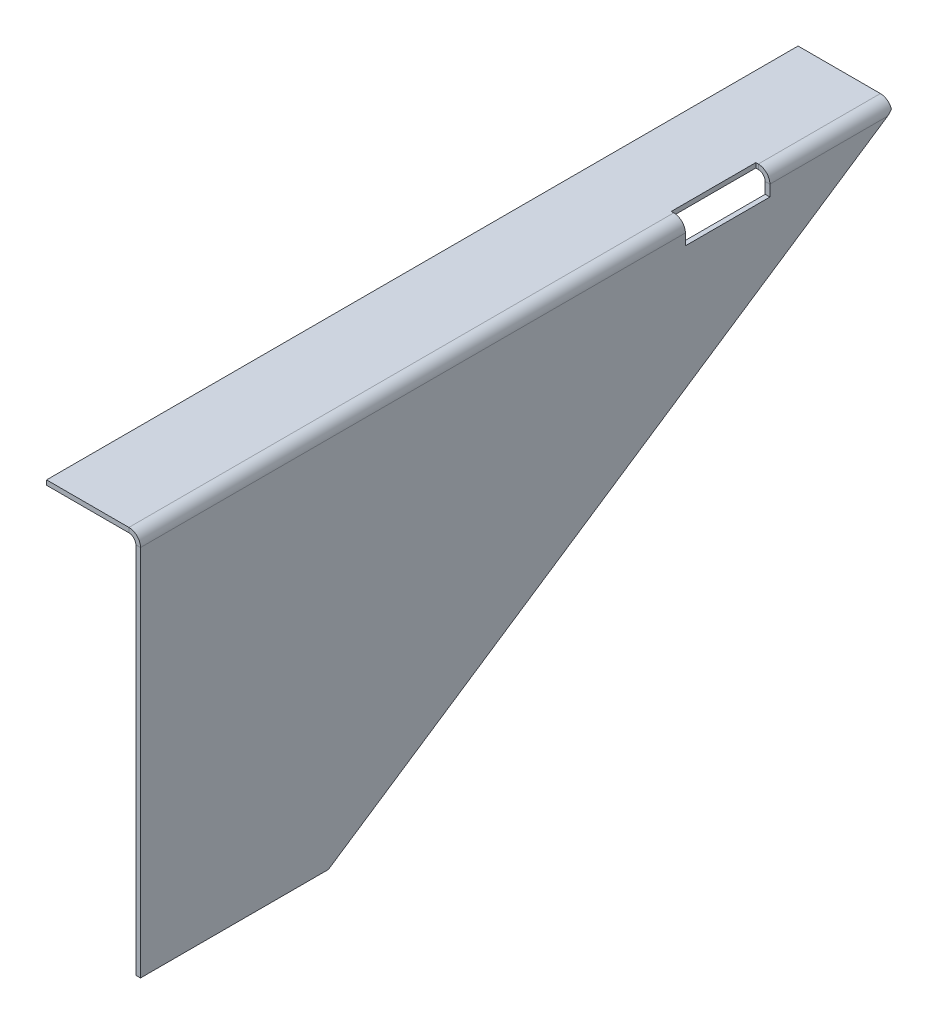
ISO-10303-21;
HEADER;
FILE_DESCRIPTION(('STEP AP214'),'2;1');
FILE_NAME('part.step','',(''),(''),'','','');
FILE_SCHEMA(('AUTOMOTIVE_DESIGN { 1 0 10303 214 1 1 1 1 }'));
ENDSEC;
DATA;
#1=APPLICATION_CONTEXT('core data for automotive mechanical design processes');
#2=APPLICATION_PROTOCOL_DEFINITION('international standard','automotive_design',2000,#1);
#3=PRODUCT_CONTEXT('',#1,'mechanical');
#4=PRODUCT('Part','Part','',(#3));
#5=PRODUCT_RELATED_PRODUCT_CATEGORY('part','',(#4));
#6=PRODUCT_DEFINITION_FORMATION('','',#4);
#7=PRODUCT_DEFINITION_CONTEXT('part definition',#1,'design');
#8=PRODUCT_DEFINITION('design','',#6,#7);
#9=PRODUCT_DEFINITION_SHAPE('','',#8);
#10=(LENGTH_UNIT() NAMED_UNIT(*) SI_UNIT(.MILLI.,.METRE.));
#11=(NAMED_UNIT(*) PLANE_ANGLE_UNIT() SI_UNIT($,.RADIAN.));
#12=(NAMED_UNIT(*) SI_UNIT($,.STERADIAN.) SOLID_ANGLE_UNIT());
#13=UNCERTAINTY_MEASURE_WITH_UNIT(LENGTH_MEASURE(1.E-05),#10,'distance_accuracy_value','');
#14=(GEOMETRIC_REPRESENTATION_CONTEXT(3) GLOBAL_UNCERTAINTY_ASSIGNED_CONTEXT((#13)) GLOBAL_UNIT_ASSIGNED_CONTEXT((#10,
#11,#12)) REPRESENTATION_CONTEXT('',''));
#15=CARTESIAN_POINT('',(0.,0.,0.));
#16=DIRECTION('',(0.,0.,1.));
#17=DIRECTION('',(1.,0.,0.));
#18=AXIS2_PLACEMENT_3D('',#15,#16,#17);
#19=CARTESIAN_POINT('',(-15.5000000000001,-15.9234523439842,0.));
#20=DIRECTION('',(1.,0.,0.));
#21=DIRECTION('',(0.,0.,1.));
#22=AXIS2_PLACEMENT_3D('',#19,#20,#21);
#23=PLANE('',#22);
#24=DIRECTION('',(0.,-1.,0.));
#25=VECTOR('',#24,1.);
#26=CARTESIAN_POINT('',(-15.5,9.07654765601584,40.));
#27=LINE('',#26,#25);
#28=CARTESIAN_POINT('',(-15.5,-1.2366,40.));
#29=VERTEX_POINT('',#28);
#30=CARTESIAN_POINT('',(-15.5000000000001,-40.9234523439842,40.));
#31=VERTEX_POINT('',#30);
#32=EDGE_CURVE('E223',#29,#31,#27,.T.);
#33=ORIENTED_EDGE('',*,*,#32,.F.);
#34=DIRECTION('',(0.,0.,-1.));
#35=VECTOR('',#34,1.);
#36=CARTESIAN_POINT('',(-15.5,-1.2366,0.));
#37=LINE('',#36,#35);
#38=CARTESIAN_POINT('',(-15.5,-1.2366,-18.));
#39=VERTEX_POINT('',#38);
#40=EDGE_CURVE('E377',#29,#39,#37,.T.);
#41=ORIENTED_EDGE('',*,*,#40,.T.);
#42=DIRECTION('',(0.,1.,0.));
#43=VECTOR('',#42,1.);
#44=CARTESIAN_POINT('',(-15.5,0.576547656015846,-18.));
#45=LINE('',#44,#43);
#46=CARTESIAN_POINT('',(-15.5,-2.42345234398416,-18.));
#47=VERTEX_POINT('',#46);
#48=EDGE_CURVE('E216',#47,#39,#45,.T.);
#49=ORIENTED_EDGE('',*,*,#48,.F.);
#50=DIRECTION('',(0.,0.,-1.));
#51=VECTOR('',#50,1.);
#52=CARTESIAN_POINT('',(-15.5,-2.42345234398416,-27.));
#53=LINE('',#52,#51);
#54=CARTESIAN_POINT('',(-15.5,-2.42345234398416,-27.));
#55=VERTEX_POINT('',#54);
#56=EDGE_CURVE('E198',#47,#55,#53,.T.);
#57=ORIENTED_EDGE('',*,*,#56,.T.);
#58=DIRECTION('',(0.,1.,0.));
#59=VECTOR('',#58,1.);
#60=CARTESIAN_POINT('',(-15.5,0.576547656015849,-27.));
#61=LINE('',#60,#59);
#62=CARTESIAN_POINT('',(-15.5,-1.2366,-27.));
#63=VERTEX_POINT('',#62);
#64=EDGE_CURVE('E195',#55,#63,#61,.T.);
#65=ORIENTED_EDGE('',*,*,#64,.T.);
#66=DIRECTION('',(0.,0.,-1.));
#67=VECTOR('',#66,1.);
#68=CARTESIAN_POINT('',(-15.5,-1.2366,0.));
#69=LINE('',#68,#67);
#70=CARTESIAN_POINT('',(-15.5,-1.23659999999999,-39.5302785159762));
#71=VERTEX_POINT('',#70);
#72=EDGE_CURVE('E172',#63,#71,#69,.T.);
#73=ORIENTED_EDGE('',*,*,#72,.T.);
#74=DIRECTION('',(0.,0.554700196225229,-0.832050294337844));
#75=VECTOR('',#74,1.);
#76=CARTESIAN_POINT('',(-15.5000000000001,-40.9234523439842,20.));
#77=LINE('',#76,#75);
#78=CARTESIAN_POINT('',(-15.5000000000001,-40.9234523439842,20.));
#79=VERTEX_POINT('',#78);
#80=EDGE_CURVE('E229',#79,#71,#77,.T.);
#81=ORIENTED_EDGE('',*,*,#80,.F.);
#82=DIRECTION('',(0.,0.,-1.));
#83=VECTOR('',#82,1.);
#84=CARTESIAN_POINT('',(-15.5000000000001,-40.9234523439842,40.));
#85=LINE('',#84,#83);
#86=EDGE_CURVE('E224',#31,#79,#85,.T.);
#87=ORIENTED_EDGE('',*,*,#86,.F.);
#88=EDGE_LOOP('',(#33,#41,#49,#57,#65,#73,#81,#87));
#89=FACE_BOUND('',#88,.T.);
#90=ADVANCED_FACE('F50',(#89),#23,.F.);
#91=CARTESIAN_POINT('',(-15.501,0.576547656015846,-18.));
#92=DIRECTION('',(0.,0.,1.));
#93=DIRECTION('',(0.,-1.,0.));
#94=AXIS2_PLACEMENT_3D('',#91,#92,#93);
#95=PLANE('',#94);
#96=ORIENTED_EDGE('',*,*,#48,.T.);
#97=DIRECTION('',(1.,0.,0.));
#98=VECTOR('',#97,1.);
#99=CARTESIAN_POINT('',(-15.501,-1.23659999999999,-18.));
#100=LINE('',#99,#98);
#101=CARTESIAN_POINT('',(-15.,-1.2366,-18.));
#102=VERTEX_POINT('',#101);
#103=EDGE_CURVE('E182',#39,#102,#100,.T.);
#104=ORIENTED_EDGE('',*,*,#103,.T.);
#105=DIRECTION('',(0.,-1.,0.));
#106=VECTOR('',#105,1.);
#107=CARTESIAN_POINT('',(-15.,0.576547656015842,-18.));
#108=LINE('',#107,#106);
#109=CARTESIAN_POINT('',(-15.,-2.42345234398416,-18.));
#110=VERTEX_POINT('',#109);
#111=EDGE_CURVE('E201',#102,#110,#108,.T.);
#112=ORIENTED_EDGE('',*,*,#111,.T.);
#113=DIRECTION('',(1.,0.,0.));
#114=VECTOR('',#113,1.);
#115=CARTESIAN_POINT('',(-15.501,-2.42345234398416,-18.));
#116=LINE('',#115,#114);
#117=EDGE_CURVE('E212',#47,#110,#116,.T.);
#118=ORIENTED_EDGE('',*,*,#117,.F.);
#119=EDGE_LOOP('',(#96,#104,#112,#118));
#120=FACE_BOUND('',#119,.T.);
#121=ADVANCED_FACE('F52',(#120),#95,.F.);
#122=CARTESIAN_POINT('',(-15.5000000000001,-40.9234523439842,20.));
#123=DIRECTION('',(0.,-0.832050294337844,-0.554700196225229));
#124=DIRECTION('',(0.,0.554700196225229,-0.832050294337844));
#125=AXIS2_PLACEMENT_3D('',#122,#123,#124);
#126=PLANE('',#125);
#127=CARTESIAN_POINT('',(-15.,-1.2366,-39.5302785159762));
#128=CARTESIAN_POINT('',(-15.5,-1.2366,-39.5302785159762));
#129=B_SPLINE_CURVE_WITH_KNOTS('',1,(#127,#128),.UNSPECIFIED.,.F.,.F.,(2,2),(0.,1.),.UNSPECIFIED.);
#130=CARTESIAN_POINT('',(-15.,-1.23659999999999,-39.5302785159762));
#131=VERTEX_POINT('',#130);
#132=EDGE_CURVE('E12',#131,#71,#129,.T.);
#133=ORIENTED_EDGE('',*,*,#132,.F.);
#134=DIRECTION('',(0.,0.554700196225229,-0.832050294337844));
#135=VECTOR('',#134,1.);
#136=CARTESIAN_POINT('',(-15.0000000000001,-40.9234523439842,20.));
#137=LINE('',#136,#135);
#138=CARTESIAN_POINT('',(-15.0000000000001,-40.9234523439842,20.));
#139=VERTEX_POINT('',#138);
#140=EDGE_CURVE('E225',#139,#131,#137,.T.);
#141=ORIENTED_EDGE('',*,*,#140,.F.);
#142=DIRECTION('',(1.,0.,0.));
#143=VECTOR('',#142,1.);
#144=CARTESIAN_POINT('',(-15.5000000000001,-40.9234523439842,20.));
#145=LINE('',#144,#143);
#146=EDGE_CURVE('E375',#79,#139,#145,.T.);
#147=ORIENTED_EDGE('',*,*,#146,.F.);
#148=ORIENTED_EDGE('',*,*,#80,.T.);
#149=EDGE_LOOP('',(#133,#141,#147,#148));
#150=FACE_BOUND('',#149,.T.);
#151=ADVANCED_FACE('F242',(#150),#126,.T.);
#152=CARTESIAN_POINT('',(-15.5000000000001,-40.9234523439842,40.));
#153=DIRECTION('',(0.,-1.,0.));
#154=DIRECTION('',(0.,0.,-1.));
#155=AXIS2_PLACEMENT_3D('',#152,#153,#154);
#156=PLANE('',#155);
#157=DIRECTION('',(0.,0.,-1.));
#158=VECTOR('',#157,1.);
#159=CARTESIAN_POINT('',(-15.0000000000001,-40.9234523439842,40.));
#160=LINE('',#159,#158);
#161=CARTESIAN_POINT('',(-15.0000000000001,-40.9234523439842,40.));
#162=VERTEX_POINT('',#161);
#163=EDGE_CURVE('E222',#162,#139,#160,.T.);
#164=ORIENTED_EDGE('',*,*,#163,.F.);
#165=DIRECTION('',(1.,0.,0.));
#166=VECTOR('',#165,1.);
#167=CARTESIAN_POINT('',(-15.5000000000001,-40.9234523439842,40.));
#168=LINE('',#167,#166);
#169=EDGE_CURVE('E231',#31,#162,#168,.T.);
#170=ORIENTED_EDGE('',*,*,#169,.F.);
#171=ORIENTED_EDGE('',*,*,#86,.T.);
#172=ORIENTED_EDGE('',*,*,#146,.T.);
#173=EDGE_LOOP('',(#164,#170,#171,#172));
#174=FACE_BOUND('',#173,.T.);
#175=ADVANCED_FACE('F486',(#174),#156,.T.);
#176=CARTESIAN_POINT('',(-15.5,9.07654765601584,40.));
#177=DIRECTION('',(0.,0.,1.));
#178=DIRECTION('',(0.,-1.,0.));
#179=AXIS2_PLACEMENT_3D('',#176,#177,#178);
#180=PLANE('',#179);
#181=DIRECTION('',(1.,0.,0.));
#182=VECTOR('',#181,1.);
#183=CARTESIAN_POINT('',(-15.5,-1.2366,40.));
#184=LINE('',#183,#182);
#185=CARTESIAN_POINT('',(-15.,-1.2366,40.));
#186=VERTEX_POINT('',#185);
#187=EDGE_CURVE('E382',#29,#186,#184,.T.);
#188=ORIENTED_EDGE('',*,*,#187,.F.);
#189=ORIENTED_EDGE('',*,*,#32,.T.);
#190=ORIENTED_EDGE('',*,*,#169,.T.);
#191=DIRECTION('',(0.,-1.,0.));
#192=VECTOR('',#191,1.);
#193=CARTESIAN_POINT('',(-15.,9.07654765601584,40.));
#194=LINE('',#193,#192);
#195=EDGE_CURVE('E219',#186,#162,#194,.T.);
#196=ORIENTED_EDGE('',*,*,#195,.F.);
#197=EDGE_LOOP('',(#188,#189,#190,#196));
#198=FACE_BOUND('',#197,.T.);
#199=ADVANCED_FACE('F483',(#198),#180,.T.);
#200=CARTESIAN_POINT('',(-15.0000000000001,-15.9234523439842,0.));
#201=DIRECTION('',(1.,0.,0.));
#202=DIRECTION('',(0.,0.,1.));
#203=AXIS2_PLACEMENT_3D('',#200,#201,#202);
#204=PLANE('',#203);
#205=DIRECTION('',(0.,0.,-1.));
#206=VECTOR('',#205,1.);
#207=CARTESIAN_POINT('',(-15.,-1.2366,0.));
#208=LINE('',#207,#206);
#209=EDGE_CURVE('E383',#186,#102,#208,.T.);
#210=ORIENTED_EDGE('',*,*,#209,.F.);
#211=ORIENTED_EDGE('',*,*,#195,.T.);
#212=ORIENTED_EDGE('',*,*,#163,.T.);
#213=ORIENTED_EDGE('',*,*,#140,.T.);
#214=DIRECTION('',(0.,0.,-1.));
#215=VECTOR('',#214,1.);
#216=CARTESIAN_POINT('',(-15.,-1.2366,0.));
#217=LINE('',#216,#215);
#218=CARTESIAN_POINT('',(-15.,-1.23659999999999,-27.));
#219=VERTEX_POINT('',#218);
#220=EDGE_CURVE('E61',#219,#131,#217,.T.);
#221=ORIENTED_EDGE('',*,*,#220,.F.);
#222=DIRECTION('',(0.,-1.,0.));
#223=VECTOR('',#222,1.);
#224=CARTESIAN_POINT('',(-15.,0.576547656015846,-27.));
#225=LINE('',#224,#223);
#226=CARTESIAN_POINT('',(-15.,-2.42345234398416,-27.));
#227=VERTEX_POINT('',#226);
#228=EDGE_CURVE('E205',#219,#227,#225,.T.);
#229=ORIENTED_EDGE('',*,*,#228,.T.);
#230=DIRECTION('',(0.,0.,1.));
#231=VECTOR('',#230,1.);
#232=CARTESIAN_POINT('',(-15.,-2.42345234398416,-27.));
#233=LINE('',#232,#231);
#234=EDGE_CURVE('E213',#227,#110,#233,.T.);
#235=ORIENTED_EDGE('',*,*,#234,.T.);
#236=ORIENTED_EDGE('',*,*,#111,.F.);
#237=EDGE_LOOP('',(#210,#211,#212,#213,#221,#229,#235,#236));
#238=FACE_BOUND('',#237,.T.);
#239=ADVANCED_FACE('F485',(#238),#204,.T.);
#240=CARTESIAN_POINT('',(-15.501,0.576547656015849,-27.));
#241=DIRECTION('',(0.,0.,1.));
#242=DIRECTION('',(0.,-1.,0.));
#243=AXIS2_PLACEMENT_3D('',#240,#241,#242);
#244=PLANE('',#243);
#245=DIRECTION('',(1.,0.,0.));
#246=VECTOR('',#245,1.);
#247=CARTESIAN_POINT('',(-15.501,-1.23659999999999,-27.));
#248=LINE('',#247,#246);
#249=EDGE_CURVE('E181',#63,#219,#248,.T.);
#250=ORIENTED_EDGE('',*,*,#249,.F.);
#251=ORIENTED_EDGE('',*,*,#64,.F.);
#252=DIRECTION('',(1.,0.,0.));
#253=VECTOR('',#252,1.);
#254=CARTESIAN_POINT('',(-15.501,-2.42345234398416,-27.));
#255=LINE('',#254,#253);
#256=EDGE_CURVE('E220',#55,#227,#255,.T.);
#257=ORIENTED_EDGE('',*,*,#256,.T.);
#258=ORIENTED_EDGE('',*,*,#228,.F.);
#259=EDGE_LOOP('',(#250,#251,#257,#258));
#260=FACE_BOUND('',#259,.T.);
#261=ADVANCED_FACE('F204',(#260),#244,.T.);
#262=CARTESIAN_POINT('',(-15.501,-2.42345234398416,-27.));
#263=DIRECTION('',(0.,1.,0.));
#264=DIRECTION('',(0.,0.,1.));
#265=AXIS2_PLACEMENT_3D('',#262,#263,#264);
#266=PLANE('',#265);
#267=ORIENTED_EDGE('',*,*,#117,.T.);
#268=ORIENTED_EDGE('',*,*,#234,.F.);
#269=ORIENTED_EDGE('',*,*,#256,.F.);
#270=ORIENTED_EDGE('',*,*,#56,.F.);
#271=EDGE_LOOP('',(#267,#268,#269,#270));
#272=FACE_BOUND('',#271,.T.);
#273=ADVANCED_FACE('F493',(#272),#266,.T.);
#274=CARTESIAN_POINT('',(-16.5,-0.501,-27.));
#275=DIRECTION('',(-1.,0.,0.));
#276=DIRECTION('',(0.,0.,1.));
#277=AXIS2_PLACEMENT_3D('',#274,#275,#276);
#278=PLANE('',#277);
#279=DIRECTION('',(0.,0.,-1.));
#280=VECTOR('',#279,1.);
#281=CARTESIAN_POINT('',(-16.5,-0.5,-27.));
#282=LINE('',#281,#280);
#283=CARTESIAN_POINT('',(-16.5,-0.5,-18.));
#284=VERTEX_POINT('',#283);
#285=CARTESIAN_POINT('',(-16.5,-0.5,-27.));
#286=VERTEX_POINT('',#285);
#287=EDGE_CURVE('E358',#284,#286,#282,.T.);
#288=ORIENTED_EDGE('',*,*,#287,.T.);
#289=DIRECTION('',(0.,1.,0.));
#290=VECTOR('',#289,1.);
#291=CARTESIAN_POINT('',(-16.5,-0.501,-27.));
#292=LINE('',#291,#290);
#293=CARTESIAN_POINT('',(-16.5,0.,-27.));
#294=VERTEX_POINT('',#293);
#295=EDGE_CURVE('E356',#286,#294,#292,.T.);
#296=ORIENTED_EDGE('',*,*,#295,.T.);
#297=DIRECTION('',(0.,0.,1.));
#298=VECTOR('',#297,1.);
#299=CARTESIAN_POINT('',(-16.5,0.,-27.));
#300=LINE('',#299,#298);
#301=CARTESIAN_POINT('',(-16.5,0.,-18.));
#302=VERTEX_POINT('',#301);
#303=EDGE_CURVE('E354',#294,#302,#300,.T.);
#304=ORIENTED_EDGE('',*,*,#303,.T.);
#305=DIRECTION('',(0.,1.,0.));
#306=VECTOR('',#305,1.);
#307=CARTESIAN_POINT('',(-16.5,-0.501,-18.));
#308=LINE('',#307,#306);
#309=EDGE_CURVE('E319',#284,#302,#308,.T.);
#310=ORIENTED_EDGE('',*,*,#309,.F.);
#311=EDGE_LOOP('',(#288,#296,#304,#310));
#312=FACE_BOUND('',#311,.T.);
#313=ADVANCED_FACE('F427',(#312),#278,.F.);
#314=CARTESIAN_POINT('',(-25.,-0.5,-40.));
#315=DIRECTION('',(-1.,0.,0.));
#316=DIRECTION('',(0.,0.,1.));
#317=AXIS2_PLACEMENT_3D('',#314,#315,#316);
#318=PLANE('',#317);
#319=DIRECTION('',(0.,0.,1.));
#320=VECTOR('',#319,1.);
#321=CARTESIAN_POINT('',(-25.,0.,-40.));
#322=LINE('',#321,#320);
#323=CARTESIAN_POINT('',(-25.,0.,-40.));
#324=VERTEX_POINT('',#323);
#325=CARTESIAN_POINT('',(-25.,0.,40.));
#326=VERTEX_POINT('',#325);
#327=EDGE_CURVE('E324',#324,#326,#322,.T.);
#328=ORIENTED_EDGE('',*,*,#327,.F.);
#329=DIRECTION('',(0.,1.,0.));
#330=VECTOR('',#329,1.);
#331=CARTESIAN_POINT('',(-25.,-0.5,-40.));
#332=LINE('',#331,#330);
#333=CARTESIAN_POINT('',(-25.,-0.5,-40.));
#334=VERTEX_POINT('',#333);
#335=EDGE_CURVE('E307',#334,#324,#332,.T.);
#336=ORIENTED_EDGE('',*,*,#335,.F.);
#337=DIRECTION('',(0.,0.,1.));
#338=VECTOR('',#337,1.);
#339=CARTESIAN_POINT('',(-25.,-0.5,-40.));
#340=LINE('',#339,#338);
#341=CARTESIAN_POINT('',(-25.,-0.5,40.));
#342=VERTEX_POINT('',#341);
#343=EDGE_CURVE('E351',#334,#342,#340,.T.);
#344=ORIENTED_EDGE('',*,*,#343,.T.);
#345=DIRECTION('',(0.,1.,0.));
#346=VECTOR('',#345,1.);
#347=CARTESIAN_POINT('',(-25.,-0.5,40.));
#348=LINE('',#347,#346);
#349=EDGE_CURVE('E349',#342,#326,#348,.T.);
#350=ORIENTED_EDGE('',*,*,#349,.T.);
#351=EDGE_LOOP('',(#328,#336,#344,#350));
#352=FACE_BOUND('',#351,.T.);
#353=ADVANCED_FACE('F413',(#352),#318,.T.);
#354=CARTESIAN_POINT('',(0.,-0.5,0.));
#355=DIRECTION('',(0.,1.,0.));
#356=DIRECTION('',(0.,0.,1.));
#357=AXIS2_PLACEMENT_3D('',#354,#355,#356);
#358=PLANE('',#357);
#359=DIRECTION('',(0.,0.,-1.));
#360=VECTOR('',#359,1.);
#361=CARTESIAN_POINT('',(-16.2366,-0.5,0.));
#362=LINE('',#361,#360);
#363=CARTESIAN_POINT('',(-16.2366,-0.5,40.));
#364=VERTEX_POINT('',#363);
#365=CARTESIAN_POINT('',(-16.2366,-0.5,-18.));
#366=VERTEX_POINT('',#365);
#367=EDGE_CURVE('E363',#364,#366,#362,.T.);
#368=ORIENTED_EDGE('',*,*,#367,.F.);
#369=DIRECTION('',(1.,0.,0.));
#370=VECTOR('',#369,1.);
#371=CARTESIAN_POINT('',(-25.,-0.5,40.));
#372=LINE('',#371,#370);
#373=EDGE_CURVE('E344',#342,#364,#372,.T.);
#374=ORIENTED_EDGE('',*,*,#373,.F.);
#375=ORIENTED_EDGE('',*,*,#343,.F.);
#376=DIRECTION('',(-1.,0.,0.));
#377=VECTOR('',#376,1.);
#378=CARTESIAN_POINT('',(-25.,-0.5,-40.));
#379=LINE('',#378,#377);
#380=CARTESIAN_POINT('',(-16.2366,-0.5,-40.));
#381=VERTEX_POINT('',#380);
#382=EDGE_CURVE('E310',#381,#334,#379,.T.);
#383=ORIENTED_EDGE('',*,*,#382,.F.);
#384=DIRECTION('',(0.,0.,-1.));
#385=VECTOR('',#384,1.);
#386=CARTESIAN_POINT('',(-16.2366,-0.5,0.));
#387=LINE('',#386,#385);
#388=CARTESIAN_POINT('',(-16.2366,-0.5,-27.));
#389=VERTEX_POINT('',#388);
#390=EDGE_CURVE('E301',#389,#381,#387,.T.);
#391=ORIENTED_EDGE('',*,*,#390,.F.);
#392=DIRECTION('',(-1.,0.,0.));
#393=VECTOR('',#392,1.);
#394=CARTESIAN_POINT('',(-16.5,-0.5,-27.));
#395=LINE('',#394,#393);
#396=EDGE_CURVE('E347',#389,#286,#395,.T.);
#397=ORIENTED_EDGE('',*,*,#396,.T.);
#398=ORIENTED_EDGE('',*,*,#287,.F.);
#399=DIRECTION('',(-1.,0.,0.));
#400=VECTOR('',#399,1.);
#401=CARTESIAN_POINT('',(-16.5,-0.5,-18.));
#402=LINE('',#401,#400);
#403=EDGE_CURVE('E322',#366,#284,#402,.T.);
#404=ORIENTED_EDGE('',*,*,#403,.F.);
#405=EDGE_LOOP('',(#368,#374,#375,#383,#391,#397,#398,#404));
#406=FACE_BOUND('',#405,.T.);
#407=ADVANCED_FACE('F408',(#406),#358,.F.);
#408=CARTESIAN_POINT('',(-25.,-0.5,40.));
#409=DIRECTION('',(0.,0.,1.));
#410=DIRECTION('',(1.,0.,0.));
#411=AXIS2_PLACEMENT_3D('',#408,#409,#410);
#412=PLANE('',#411);
#413=ORIENTED_EDGE('',*,*,#373,.T.);
#414=DIRECTION('',(0.,1.,0.));
#415=VECTOR('',#414,1.);
#416=CARTESIAN_POINT('',(-16.2366,-0.5,40.));
#417=LINE('',#416,#415);
#418=CARTESIAN_POINT('',(-16.2366,0.,40.));
#419=VERTEX_POINT('',#418);
#420=EDGE_CURVE('E341',#364,#419,#417,.T.);
#421=ORIENTED_EDGE('',*,*,#420,.T.);
#422=DIRECTION('',(1.,0.,0.));
#423=VECTOR('',#422,1.);
#424=CARTESIAN_POINT('',(-25.,0.,40.));
#425=LINE('',#424,#423);
#426=EDGE_CURVE('E338',#326,#419,#425,.T.);
#427=ORIENTED_EDGE('',*,*,#426,.F.);
#428=ORIENTED_EDGE('',*,*,#349,.F.);
#429=EDGE_LOOP('',(#413,#421,#427,#428));
#430=FACE_BOUND('',#429,.T.);
#431=ADVANCED_FACE('F404',(#430),#412,.T.);
#432=CARTESIAN_POINT('',(0.,0.,0.));
#433=DIRECTION('',(0.,1.,0.));
#434=DIRECTION('',(0.,0.,1.));
#435=AXIS2_PLACEMENT_3D('',#432,#433,#434);
#436=PLANE('',#435);
#437=ORIENTED_EDGE('',*,*,#426,.T.);
#438=DIRECTION('',(0.,0.,-1.));
#439=VECTOR('',#438,1.);
#440=CARTESIAN_POINT('',(-16.2366,0.,0.));
#441=LINE('',#440,#439);
#442=CARTESIAN_POINT('',(-16.2366,0.,-18.));
#443=VERTEX_POINT('',#442);
#444=EDGE_CURVE('E335',#419,#443,#441,.T.);
#445=ORIENTED_EDGE('',*,*,#444,.T.);
#446=DIRECTION('',(1.,0.,0.));
#447=VECTOR('',#446,1.);
#448=CARTESIAN_POINT('',(-16.5,0.,-18.));
#449=LINE('',#448,#447);
#450=EDGE_CURVE('E316',#302,#443,#449,.T.);
#451=ORIENTED_EDGE('',*,*,#450,.F.);
#452=ORIENTED_EDGE('',*,*,#303,.F.);
#453=DIRECTION('',(1.,0.,0.));
#454=VECTOR('',#453,1.);
#455=CARTESIAN_POINT('',(-16.5,0.,-27.));
#456=LINE('',#455,#454);
#457=CARTESIAN_POINT('',(-16.2366,0.,-27.));
#458=VERTEX_POINT('',#457);
#459=EDGE_CURVE('E332',#294,#458,#456,.T.);
#460=ORIENTED_EDGE('',*,*,#459,.T.);
#461=DIRECTION('',(0.,0.,-1.));
#462=VECTOR('',#461,1.);
#463=CARTESIAN_POINT('',(-16.2366,0.,0.));
#464=LINE('',#463,#462);
#465=CARTESIAN_POINT('',(-16.2366,0.,-40.));
#466=VERTEX_POINT('',#465);
#467=EDGE_CURVE('E329',#458,#466,#464,.T.);
#468=ORIENTED_EDGE('',*,*,#467,.T.);
#469=DIRECTION('',(-1.,0.,0.));
#470=VECTOR('',#469,1.);
#471=CARTESIAN_POINT('',(-25.,0.,-40.));
#472=LINE('',#471,#470);
#473=EDGE_CURVE('E327',#466,#324,#472,.T.);
#474=ORIENTED_EDGE('',*,*,#473,.T.);
#475=ORIENTED_EDGE('',*,*,#327,.T.);
#476=EDGE_LOOP('',(#437,#445,#451,#452,#460,#468,#474,#475));
#477=FACE_BOUND('',#476,.T.);
#478=ADVANCED_FACE('F435',(#477),#436,.T.);
#479=CARTESIAN_POINT('',(-16.5,-0.501,-18.));
#480=DIRECTION('',(0.,0.,1.));
#481=DIRECTION('',(1.,0.,0.));
#482=AXIS2_PLACEMENT_3D('',#479,#480,#481);
#483=PLANE('',#482);
#484=DIRECTION('',(0.,1.,0.));
#485=VECTOR('',#484,1.);
#486=CARTESIAN_POINT('',(-16.2366,-0.501,-18.));
#487=LINE('',#486,#485);
#488=EDGE_CURVE('E361',#366,#443,#487,.T.);
#489=ORIENTED_EDGE('',*,*,#488,.F.);
#490=ORIENTED_EDGE('',*,*,#403,.T.);
#491=ORIENTED_EDGE('',*,*,#309,.T.);
#492=ORIENTED_EDGE('',*,*,#450,.T.);
#493=EDGE_LOOP('',(#489,#490,#491,#492));
#494=FACE_BOUND('',#493,.T.);
#495=ADVANCED_FACE('F430',(#494),#483,.F.);
#496=CARTESIAN_POINT('',(-16.5,-0.501,-27.));
#497=DIRECTION('',(0.,0.,1.));
#498=DIRECTION('',(1.,0.,0.));
#499=AXIS2_PLACEMENT_3D('',#496,#497,#498);
#500=PLANE('',#499);
#501=ORIENTED_EDGE('',*,*,#396,.F.);
#502=DIRECTION('',(0.,1.,0.));
#503=VECTOR('',#502,1.);
#504=CARTESIAN_POINT('',(-16.2366,-0.501,-27.));
#505=LINE('',#504,#503);
#506=EDGE_CURVE('E189',#389,#458,#505,.T.);
#507=ORIENTED_EDGE('',*,*,#506,.T.);
#508=ORIENTED_EDGE('',*,*,#459,.F.);
#509=ORIENTED_EDGE('',*,*,#295,.F.);
#510=EDGE_LOOP('',(#501,#507,#508,#509));
#511=FACE_BOUND('',#510,.T.);
#512=ADVANCED_FACE('F422',(#511),#500,.T.);
#513=CARTESIAN_POINT('',(-25.,-0.5,-40.));
#514=DIRECTION('',(0.,0.,-1.));
#515=DIRECTION('',(-1.,0.,0.));
#516=AXIS2_PLACEMENT_3D('',#513,#514,#515);
#517=PLANE('',#516);
#518=ORIENTED_EDGE('',*,*,#473,.F.);
#519=DIRECTION('',(0.,-1.,0.));
#520=VECTOR('',#519,1.);
#521=CARTESIAN_POINT('',(-16.2366,-0.5,-40.));
#522=LINE('',#521,#520);
#523=EDGE_CURVE('E312',#466,#381,#522,.T.);
#524=ORIENTED_EDGE('',*,*,#523,.T.);
#525=ORIENTED_EDGE('',*,*,#382,.T.);
#526=ORIENTED_EDGE('',*,*,#335,.T.);
#527=EDGE_LOOP('',(#518,#524,#525,#526));
#528=FACE_BOUND('',#527,.T.);
#529=ADVANCED_FACE('F416',(#528),#517,.T.);
#530=CARTESIAN_POINT('',(-16.2366,-1.2366,40.));
#531=DIRECTION('',(0.,0.,-1.));
#532=DIRECTION('',(-1.,0.,0.));
#533=AXIS2_PLACEMENT_3D('',#530,#531,#532);
#534=PLANE('',#533);
#535=ORIENTED_EDGE('',*,*,#187,.T.);
#536=CARTESIAN_POINT('',(-16.2366,-1.2366,40.));
#537=DIRECTION('',(0.,0.,1.));
#538=DIRECTION('',(1.,0.,0.));
#539=AXIS2_PLACEMENT_3D('',#536,#537,#538);
#540=CIRCLE('',#539,1.2366);
#541=EDGE_CURVE('E302',#186,#419,#540,.T.);
#542=ORIENTED_EDGE('',*,*,#541,.T.);
#543=ORIENTED_EDGE('',*,*,#420,.F.);
#544=CARTESIAN_POINT('',(-16.2366,-1.2366,40.));
#545=DIRECTION('',(0.,0.,1.));
#546=DIRECTION('',(-1.,0.,0.));
#547=AXIS2_PLACEMENT_3D('',#544,#545,#546);
#548=CIRCLE('',#547,0.7366);
#549=EDGE_CURVE('E291',#29,#364,#548,.T.);
#550=ORIENTED_EDGE('',*,*,#549,.F.);
#551=EDGE_LOOP('',(#535,#542,#543,#550));
#552=FACE_BOUND('',#551,.T.);
#553=ADVANCED_FACE('F400',(#552),#534,.F.);
#554=CARTESIAN_POINT('',(-16.2366,-1.2366,-18.));
#555=DIRECTION('',(0.,0.,1.));
#556=DIRECTION('',(1.,0.,0.));
#557=AXIS2_PLACEMENT_3D('',#554,#555,#556);
#558=PLANE('',#557);
#559=CARTESIAN_POINT('',(-16.2366,-1.2366,-18.));
#560=DIRECTION('',(0.,0.,1.));
#561=DIRECTION('',(1.,0.,0.));
#562=AXIS2_PLACEMENT_3D('',#559,#560,#561);
#563=CIRCLE('',#562,1.2366);
#564=EDGE_CURVE('E299',#443,#102,#563,.F.);
#565=ORIENTED_EDGE('',*,*,#564,.T.);
#566=ORIENTED_EDGE('',*,*,#103,.F.);
#567=CARTESIAN_POINT('',(-16.2366,-1.2366,-18.));
#568=DIRECTION('',(0.,0.,-1.));
#569=DIRECTION('',(1.,0.,0.));
#570=AXIS2_PLACEMENT_3D('',#567,#568,#569);
#571=CIRCLE('',#570,0.7366);
#572=EDGE_CURVE('E76',#366,#39,#571,.T.);
#573=ORIENTED_EDGE('',*,*,#572,.F.);
#574=ORIENTED_EDGE('',*,*,#488,.T.);
#575=EDGE_LOOP('',(#565,#566,#573,#574));
#576=FACE_BOUND('',#575,.T.);
#577=ADVANCED_FACE('F393',(#576),#558,.F.);
#578=CARTESIAN_POINT('',(-16.2366,-1.2366,-47.0228551331053));
#579=DIRECTION('',(0.,0.,1.));
#580=DIRECTION('',(1.,0.,0.));
#581=AXIS2_PLACEMENT_3D('',#578,#579,#580);
#582=CYLINDRICAL_SURFACE('',#581,0.7366);
#583=ORIENTED_EDGE('',*,*,#367,.T.);
#584=ORIENTED_EDGE('',*,*,#572,.T.);
#585=ORIENTED_EDGE('',*,*,#40,.F.);
#586=ORIENTED_EDGE('',*,*,#549,.T.);
#587=EDGE_LOOP('',(#583,#584,#585,#586));
#588=FACE_BOUND('',#587,.T.);
#589=ADVANCED_FACE('F273',(#588),#582,.F.);
#590=CARTESIAN_POINT('',(-16.2366,-1.2366,-47.0228551331053));
#591=DIRECTION('',(0.,0.,1.));
#592=DIRECTION('',(1.,0.,0.));
#593=AXIS2_PLACEMENT_3D('',#590,#591,#592);
#594=CYLINDRICAL_SURFACE('',#593,1.2366);
#595=ORIENTED_EDGE('',*,*,#444,.F.);
#596=ORIENTED_EDGE('',*,*,#541,.F.);
#597=ORIENTED_EDGE('',*,*,#209,.T.);
#598=ORIENTED_EDGE('',*,*,#564,.F.);
#599=EDGE_LOOP('',(#595,#596,#597,#598));
#600=FACE_BOUND('',#599,.T.);
#601=ADVANCED_FACE('F432',(#600),#594,.T.);
#602=CARTESIAN_POINT('',(-16.2366,-1.2366,-27.));
#603=DIRECTION('',(0.,0.,-1.));
#604=DIRECTION('',(-1.,0.,0.));
#605=AXIS2_PLACEMENT_3D('',#602,#603,#604);
#606=PLANE('',#605);
#607=ORIENTED_EDGE('',*,*,#249,.T.);
#608=CARTESIAN_POINT('',(-16.2366,-1.2366,-27.));
#609=DIRECTION('',(0.,0.,1.));
#610=DIRECTION('',(1.,0.,0.));
#611=AXIS2_PLACEMENT_3D('',#608,#609,#610);
#612=CIRCLE('',#611,1.2366);
#613=EDGE_CURVE('E440',#219,#458,#612,.T.);
#614=ORIENTED_EDGE('',*,*,#613,.T.);
#615=ORIENTED_EDGE('',*,*,#506,.F.);
#616=CARTESIAN_POINT('',(-16.2366,-1.2366,-27.));
#617=DIRECTION('',(0.,0.,1.));
#618=DIRECTION('',(1.,0.,0.));
#619=AXIS2_PLACEMENT_3D('',#616,#617,#618);
#620=CIRCLE('',#619,0.7366);
#621=EDGE_CURVE('E175',#63,#389,#620,.T.);
#622=ORIENTED_EDGE('',*,*,#621,.F.);
#623=EDGE_LOOP('',(#607,#614,#615,#622));
#624=FACE_BOUND('',#623,.T.);
#625=ADVANCED_FACE('F185',(#624),#606,.F.);
#626=CARTESIAN_POINT('',(-16.2366,-1.2366,-40.));
#627=DIRECTION('',(0.,0.,1.));
#628=DIRECTION('',(1.,0.,0.));
#629=AXIS2_PLACEMENT_3D('',#626,#627,#628);
#630=PLANE('',#629);
#631=ORIENTED_EDGE('',*,*,#523,.F.);
#632=CARTESIAN_POINT('',(-16.2366,-1.2366,-40.));
#633=DIRECTION('',(0.,0.,1.));
#634=DIRECTION('',(1.,0.,0.));
#635=AXIS2_PLACEMENT_3D('',#632,#633,#634);
#636=CIRCLE('',#635,1.2366);
#637=CARTESIAN_POINT('',(-15.0617683880511,-0.850659274543865,-40.));
#638=VERTEX_POINT('',#637);
#639=EDGE_CURVE('E442',#466,#638,#636,.F.);
#640=ORIENTED_EDGE('',*,*,#639,.T.);
#641=CARTESIAN_POINT('',(-15.5367932998855,-1.00670841147421,-40.));
#642=CARTESIAN_POINT('',(-15.0617683880511,-0.850659274543865,-40.));
#643=B_SPLINE_CURVE_WITH_KNOTS('',1,(#641,#642),.UNSPECIFIED.,.F.,.F.,(2,2),(0.,1.),.UNSPECIFIED.);
#644=CARTESIAN_POINT('',(-15.5367932998855,-1.00670841147421,-40.));
#645=VERTEX_POINT('',#644);
#646=EDGE_CURVE('E304',#638,#645,#643,.F.);
#647=ORIENTED_EDGE('',*,*,#646,.T.);
#648=CARTESIAN_POINT('',(-16.2366,-1.2366,-40.));
#649=DIRECTION('',(0.,0.,-1.));
#650=DIRECTION('',(1.,0.,0.));
#651=AXIS2_PLACEMENT_3D('',#648,#649,#650);
#652=CIRCLE('',#651,0.7366);
#653=EDGE_CURVE('E190',#381,#645,#652,.T.);
#654=ORIENTED_EDGE('',*,*,#653,.F.);
#655=EDGE_LOOP('',(#631,#640,#647,#654));
#656=FACE_BOUND('',#655,.T.);
#657=ADVANCED_FACE('F271',(#656),#630,.F.);
#658=CARTESIAN_POINT('',(-15.0617683880511,-0.850659274543865,-40.));
#659=CARTESIAN_POINT('',(-15.0209308516181,-0.974971702829019,-39.8434073779186));
#660=CARTESIAN_POINT('',(-15.,-1.1057516747984,-39.6868711380576));
#661=CARTESIAN_POINT('',(-15.,-1.2366,-39.5302785159762));
#662=CARTESIAN_POINT('',(-15.5367932998855,-1.00670841147421,-40.));
#663=CARTESIAN_POINT('',(-15.5124692526873,-1.08075257860709,-39.8434168136401));
#664=CARTESIAN_POINT('',(-15.5,-1.15866285892782,-39.6868617023362));
#665=CARTESIAN_POINT('',(-15.5,-1.2366,-39.5302785159762));
#666=B_SPLINE_SURFACE_WITH_KNOTS('',1,3,((#658,#659,#660,#661),(#662,#663,#664,#665)),
.UNSPECIFIED.,.F.,.F.,.F.,(2,2),(4,4),(0.,1.),(0.,1.),.UNSPECIFIED.);
#667=CARTESIAN_POINT('',(-15.0617683880511,-0.850659274543865,-40.));
#668=CARTESIAN_POINT('',(-15.0209308516181,-0.974971702829019,-39.8434073779186));
#669=CARTESIAN_POINT('',(-15.,-1.1057516747984,-39.6868711380576));
#670=CARTESIAN_POINT('',(-15.,-1.2366,-39.5302785159762));
#671=B_SPLINE_CURVE_WITH_KNOTS('',3,(#667,#668,#669,#670),.UNSPECIFIED.,.F.,.F.,(4,4),(0.,1.),.UNSPECIFIED.);
#672=EDGE_CURVE('E191',#638,#131,#671,.T.);
#673=CARTESIAN_POINT('',(-15.5,-1.2366,-39.5302785159762));
#674=CARTESIAN_POINT('',(-15.5,-1.15866285892782,-39.6868617023362));
#675=CARTESIAN_POINT('',(-15.5124692526873,-1.08075257860709,-39.8434168136401));
#676=CARTESIAN_POINT('',(-15.5367932998855,-1.00670841147421,-40.));
#677=B_SPLINE_CURVE_WITH_KNOTS('',3,(#673,#674,#675,#676),.UNSPECIFIED.,.F.,.F.,(4,4),(0.,1.),.UNSPECIFIED.);
#678=EDGE_CURVE('E68',#645,#71,#677,.F.);
#679=ORIENTED_EDGE('',*,*,#672,.T.);
#680=ORIENTED_EDGE('',*,*,#132,.T.);
#681=ORIENTED_EDGE('',*,*,#678,.F.);
#682=ORIENTED_EDGE('',*,*,#646,.F.);
#683=EDGE_LOOP('',(#679,#680,#681,#682));
#684=FACE_BOUND('',#683,.T.);
#685=ADVANCED_FACE('F247',(#684),#666,.F.);
#686=CARTESIAN_POINT('',(-16.2366,-1.2366,-46.6015921855829));
#687=DIRECTION('',(0.,0.,1.));
#688=DIRECTION('',(1.,0.,0.));
#689=AXIS2_PLACEMENT_3D('',#686,#687,#688);
#690=CYLINDRICAL_SURFACE('',#689,0.7366);
#691=ORIENTED_EDGE('',*,*,#653,.T.);
#692=ORIENTED_EDGE('',*,*,#678,.T.);
#693=ORIENTED_EDGE('',*,*,#72,.F.);
#694=ORIENTED_EDGE('',*,*,#621,.T.);
#695=ORIENTED_EDGE('',*,*,#390,.T.);
#696=EDGE_LOOP('',(#691,#692,#693,#694,#695));
#697=FACE_BOUND('',#696,.T.);
#698=ADVANCED_FACE('F174',(#697),#690,.F.);
#699=CARTESIAN_POINT('',(-16.2366,-1.2366,-46.6015921855829));
#700=DIRECTION('',(0.,0.,1.));
#701=DIRECTION('',(1.,0.,0.));
#702=AXIS2_PLACEMENT_3D('',#699,#700,#701);
#703=CYLINDRICAL_SURFACE('',#702,1.2366);
#704=ORIENTED_EDGE('',*,*,#639,.F.);
#705=ORIENTED_EDGE('',*,*,#467,.F.);
#706=ORIENTED_EDGE('',*,*,#613,.F.);
#707=ORIENTED_EDGE('',*,*,#220,.T.);
#708=ORIENTED_EDGE('',*,*,#672,.F.);
#709=EDGE_LOOP('',(#704,#705,#706,#707,#708));
#710=FACE_BOUND('',#709,.T.);
#711=ADVANCED_FACE('F439',(#710),#703,.T.);
#712=CLOSED_SHELL('',(#90,#121,#151,#175,#199,#239,#261,#273,#313,#353,#407,#431,#478,#495,#512,
#529,#553,#577,#589,#601,#625,#657,#685,#698,#711));
#713=MANIFOLD_SOLID_BREP('B2',#712);
#714=ADVANCED_BREP_SHAPE_REPRESENTATION('',(#18,#713),#14);
#715=SHAPE_DEFINITION_REPRESENTATION(#9,#714);
ENDSEC;
END-ISO-10303-21;
